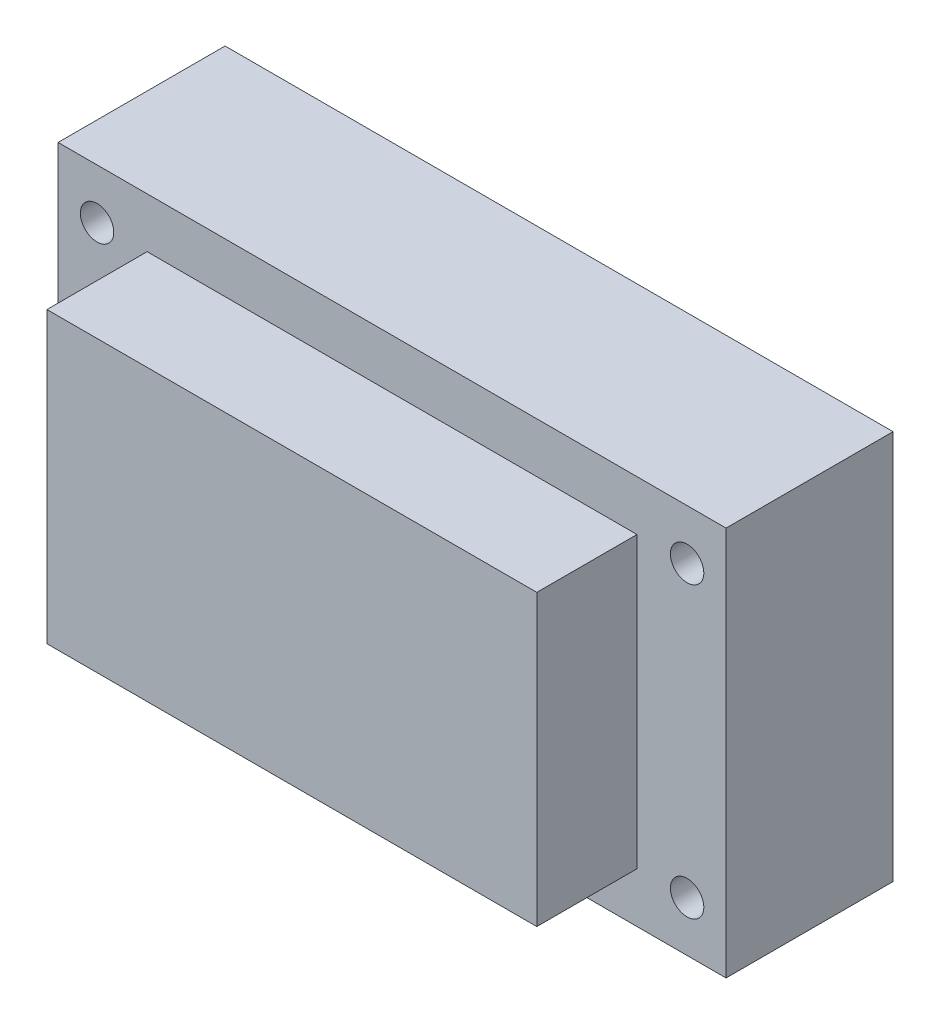
ISO-10303-21;
HEADER;
FILE_DESCRIPTION(('STEP AP214'),'2;1');
FILE_NAME('part.step','',(''),(''),'','','');
FILE_SCHEMA(('AUTOMOTIVE_DESIGN { 1 0 10303 214 1 1 1 1 }'));
ENDSEC;
DATA;
#1=APPLICATION_CONTEXT('core data for automotive mechanical design processes');
#2=APPLICATION_PROTOCOL_DEFINITION('international standard','automotive_design',2000,#1);
#3=PRODUCT_CONTEXT('',#1,'mechanical');
#4=PRODUCT('Part','Part','',(#3));
#5=PRODUCT_RELATED_PRODUCT_CATEGORY('part','',(#4));
#6=PRODUCT_DEFINITION_FORMATION('','',#4);
#7=PRODUCT_DEFINITION_CONTEXT('part definition',#1,'design');
#8=PRODUCT_DEFINITION('design','',#6,#7);
#9=PRODUCT_DEFINITION_SHAPE('','',#8);
#10=(LENGTH_UNIT() NAMED_UNIT(*) SI_UNIT(.MILLI.,.METRE.));
#11=(NAMED_UNIT(*) PLANE_ANGLE_UNIT() SI_UNIT($,.RADIAN.));
#12=(NAMED_UNIT(*) SI_UNIT($,.STERADIAN.) SOLID_ANGLE_UNIT());
#13=UNCERTAINTY_MEASURE_WITH_UNIT(LENGTH_MEASURE(1.E-05),#10,'distance_accuracy_value','');
#14=(GEOMETRIC_REPRESENTATION_CONTEXT(3) GLOBAL_UNCERTAINTY_ASSIGNED_CONTEXT((#13)) GLOBAL_UNIT_ASSIGNED_CONTEXT((#10,
#11,#12)) REPRESENTATION_CONTEXT('',''));
#15=CARTESIAN_POINT('',(0.,0.,0.));
#16=DIRECTION('',(0.,0.,1.));
#17=DIRECTION('',(1.,0.,0.));
#18=AXIS2_PLACEMENT_3D('',#15,#16,#17);
#19=CARTESIAN_POINT('',(0.,0.,9.));
#20=DIRECTION('',(1.,0.,0.));
#21=DIRECTION('',(0.,0.,-1.));
#22=AXIS2_PLACEMENT_3D('',#19,#20,#21);
#23=PLANE('',#22);
#24=DIRECTION('',(0.,-1.,0.));
#25=VECTOR('',#24,1.);
#26=CARTESIAN_POINT('',(0.,0.,0.));
#27=LINE('',#26,#25);
#28=CARTESIAN_POINT('',(0.,26.,0.));
#29=VERTEX_POINT('',#28);
#30=CARTESIAN_POINT('',(0.,0.,0.));
#31=VERTEX_POINT('',#30);
#32=EDGE_CURVE('E118',#29,#31,#27,.T.);
#33=ORIENTED_EDGE('',*,*,#32,.T.);
#34=DIRECTION('',(0.,0.,-1.));
#35=VECTOR('',#34,1.);
#36=CARTESIAN_POINT('',(0.,0.,9.));
#37=LINE('',#36,#35);
#38=CARTESIAN_POINT('',(0.,0.,9.));
#39=VERTEX_POINT('',#38);
#40=EDGE_CURVE('E11',#39,#31,#37,.T.);
#41=ORIENTED_EDGE('',*,*,#40,.F.);
#42=DIRECTION('',(0.,-1.,0.));
#43=VECTOR('',#42,1.);
#44=CARTESIAN_POINT('',(0.,0.,9.));
#45=LINE('',#44,#43);
#46=CARTESIAN_POINT('',(0.,26.,9.));
#47=VERTEX_POINT('',#46);
#48=EDGE_CURVE('E127',#47,#39,#45,.T.);
#49=ORIENTED_EDGE('',*,*,#48,.F.);
#50=DIRECTION('',(0.,0.,-1.));
#51=VECTOR('',#50,1.);
#52=CARTESIAN_POINT('',(0.,26.,9.));
#53=LINE('',#52,#51);
#54=EDGE_CURVE('E134',#47,#29,#53,.T.);
#55=ORIENTED_EDGE('',*,*,#54,.T.);
#56=EDGE_LOOP('',(#33,#41,#49,#55));
#57=FACE_BOUND('',#56,.T.);
#58=ADVANCED_FACE('F32',(#57),#23,.F.);
#59=CARTESIAN_POINT('',(0.,0.,9.));
#60=DIRECTION('',(0.,1.,0.));
#61=DIRECTION('',(0.,0.,1.));
#62=AXIS2_PLACEMENT_3D('',#59,#60,#61);
#63=PLANE('',#62);
#64=DIRECTION('',(1.,0.,0.));
#65=VECTOR('',#64,1.);
#66=CARTESIAN_POINT('',(0.,0.,0.));
#67=LINE('',#66,#65);
#68=CARTESIAN_POINT('',(44.,0.,0.));
#69=VERTEX_POINT('',#68);
#70=EDGE_CURVE('E121',#31,#69,#67,.T.);
#71=ORIENTED_EDGE('',*,*,#70,.T.);
#72=DIRECTION('',(0.,0.,-1.));
#73=VECTOR('',#72,1.);
#74=CARTESIAN_POINT('',(44.,0.,9.));
#75=LINE('',#74,#73);
#76=CARTESIAN_POINT('',(44.,0.,9.));
#77=VERTEX_POINT('',#76);
#78=EDGE_CURVE('E40',#77,#69,#75,.T.);
#79=ORIENTED_EDGE('',*,*,#78,.F.);
#80=DIRECTION('',(1.,0.,0.));
#81=VECTOR('',#80,1.);
#82=CARTESIAN_POINT('',(0.,0.,9.));
#83=LINE('',#82,#81);
#84=EDGE_CURVE('E129',#39,#77,#83,.T.);
#85=ORIENTED_EDGE('',*,*,#84,.F.);
#86=ORIENTED_EDGE('',*,*,#40,.T.);
#87=EDGE_LOOP('',(#71,#79,#85,#86));
#88=FACE_BOUND('',#87,.T.);
#89=ADVANCED_FACE('F154',(#88),#63,.F.);
#90=CARTESIAN_POINT('',(44.,0.,9.));
#91=DIRECTION('',(-1.,0.,0.));
#92=DIRECTION('',(0.,0.,1.));
#93=AXIS2_PLACEMENT_3D('',#90,#91,#92);
#94=PLANE('',#93);
#95=DIRECTION('',(0.,1.,0.));
#96=VECTOR('',#95,1.);
#97=CARTESIAN_POINT('',(44.,0.,0.));
#98=LINE('',#97,#96);
#99=CARTESIAN_POINT('',(44.,26.,0.));
#100=VERTEX_POINT('',#99);
#101=EDGE_CURVE('E138',#69,#100,#98,.T.);
#102=ORIENTED_EDGE('',*,*,#101,.T.);
#103=DIRECTION('',(0.,0.,-1.));
#104=VECTOR('',#103,1.);
#105=CARTESIAN_POINT('',(44.,26.,9.));
#106=LINE('',#105,#104);
#107=CARTESIAN_POINT('',(44.,26.,9.));
#108=VERTEX_POINT('',#107);
#109=EDGE_CURVE('E145',#108,#100,#106,.T.);
#110=ORIENTED_EDGE('',*,*,#109,.F.);
#111=DIRECTION('',(0.,1.,0.));
#112=VECTOR('',#111,1.);
#113=CARTESIAN_POINT('',(44.,0.,9.));
#114=LINE('',#113,#112);
#115=EDGE_CURVE('E132',#77,#108,#114,.T.);
#116=ORIENTED_EDGE('',*,*,#115,.F.);
#117=ORIENTED_EDGE('',*,*,#78,.T.);
#118=EDGE_LOOP('',(#102,#110,#116,#117));
#119=FACE_BOUND('',#118,.T.);
#120=ADVANCED_FACE('F151',(#119),#94,.F.);
#121=CARTESIAN_POINT('',(0.,26.,9.));
#122=DIRECTION('',(0.,-1.,0.));
#123=DIRECTION('',(0.,0.,-1.));
#124=AXIS2_PLACEMENT_3D('',#121,#122,#123);
#125=PLANE('',#124);
#126=DIRECTION('',(-1.,0.,0.));
#127=VECTOR('',#126,1.);
#128=CARTESIAN_POINT('',(0.,26.,0.));
#129=LINE('',#128,#127);
#130=EDGE_CURVE('E130',#100,#29,#129,.T.);
#131=ORIENTED_EDGE('',*,*,#130,.T.);
#132=ORIENTED_EDGE('',*,*,#54,.F.);
#133=DIRECTION('',(-1.,0.,0.));
#134=VECTOR('',#133,1.);
#135=CARTESIAN_POINT('',(0.,26.,9.));
#136=LINE('',#135,#134);
#137=EDGE_CURVE('E47',#108,#47,#136,.T.);
#138=ORIENTED_EDGE('',*,*,#137,.F.);
#139=ORIENTED_EDGE('',*,*,#109,.T.);
#140=EDGE_LOOP('',(#131,#132,#138,#139));
#141=FACE_BOUND('',#140,.T.);
#142=ADVANCED_FACE('F160',(#141),#125,.F.);
#143=CARTESIAN_POINT('',(0.,0.,9.));
#144=DIRECTION('',(0.,0.,-1.));
#145=DIRECTION('',(-1.,0.,0.));
#146=AXIS2_PLACEMENT_3D('',#143,#144,#145);
#147=PLANE('',#146);
#148=ORIENTED_EDGE('',*,*,#48,.T.);
#149=ORIENTED_EDGE('',*,*,#84,.T.);
#150=ORIENTED_EDGE('',*,*,#115,.T.);
#151=ORIENTED_EDGE('',*,*,#137,.T.);
#152=EDGE_LOOP('',(#148,#149,#150,#151));
#153=FACE_BOUND('',#152,.T.);
#154=ADVANCED_FACE('F163',(#153),#147,.F.);
#155=CARTESIAN_POINT('',(0.,0.,0.));
#156=DIRECTION('',(0.,0.,-1.));
#157=DIRECTION('',(-1.,0.,0.));
#158=AXIS2_PLACEMENT_3D('',#155,#156,#157);
#159=PLANE('',#158);
#160=DIRECTION('',(0.,1.,0.));
#161=VECTOR('',#160,1.);
#162=CARTESIAN_POINT('',(-8.,30.5,0.));
#163=LINE('',#162,#161);
#164=CARTESIAN_POINT('',(-8.,-4.5,0.));
#165=VERTEX_POINT('',#164);
#166=CARTESIAN_POINT('',(-8.,30.5,0.));
#167=VERTEX_POINT('',#166);
#168=EDGE_CURVE('E117',#165,#167,#163,.T.);
#169=ORIENTED_EDGE('',*,*,#168,.F.);
#170=DIRECTION('',(-1.,0.,0.));
#171=VECTOR('',#170,1.);
#172=CARTESIAN_POINT('',(52.,-4.5,0.));
#173=LINE('',#172,#171);
#174=CARTESIAN_POINT('',(52.,-4.5,0.));
#175=VERTEX_POINT('',#174);
#176=EDGE_CURVE('E113',#175,#165,#173,.T.);
#177=ORIENTED_EDGE('',*,*,#176,.F.);
#178=DIRECTION('',(0.,-1.,0.));
#179=VECTOR('',#178,1.);
#180=CARTESIAN_POINT('',(52.,30.5,0.));
#181=LINE('',#180,#179);
#182=CARTESIAN_POINT('',(52.,30.5,0.));
#183=VERTEX_POINT('',#182);
#184=EDGE_CURVE('E318',#183,#175,#181,.T.);
#185=ORIENTED_EDGE('',*,*,#184,.F.);
#186=DIRECTION('',(1.,0.,0.));
#187=VECTOR('',#186,1.);
#188=CARTESIAN_POINT('',(52.,30.5,0.));
#189=LINE('',#188,#187);
#190=EDGE_CURVE('E316',#167,#183,#189,.T.);
#191=ORIENTED_EDGE('',*,*,#190,.F.);
#192=EDGE_LOOP('',(#169,#177,#185,#191));
#193=FACE_BOUND('',#192,.T.);
#194=CARTESIAN_POINT('',(48.5,26.,0.));
#195=DIRECTION('',(0.,0.,-1.));
#196=DIRECTION('',(-1.,0.,0.));
#197=AXIS2_PLACEMENT_3D('',#194,#195,#196);
#198=CIRCLE('',#197,1.5);
#199=CARTESIAN_POINT('',(47.,26.,0.));
#200=VERTEX_POINT('',#199);
#201=EDGE_CURVE('E304',#200,#200,#198,.T.);
#202=ORIENTED_EDGE('',*,*,#201,.T.);
#203=EDGE_LOOP('',(#202));
#204=FACE_BOUND('',#203,.T.);
#205=CARTESIAN_POINT('',(-4.5,26.,0.));
#206=DIRECTION('',(0.,0.,-1.));
#207=DIRECTION('',(1.,0.,0.));
#208=AXIS2_PLACEMENT_3D('',#205,#206,#207);
#209=CIRCLE('',#208,1.5);
#210=CARTESIAN_POINT('',(-2.99999999999999,26.,0.));
#211=VERTEX_POINT('',#210);
#212=EDGE_CURVE('E298',#211,#211,#209,.T.);
#213=ORIENTED_EDGE('',*,*,#212,.T.);
#214=EDGE_LOOP('',(#213));
#215=FACE_BOUND('',#214,.T.);
#216=CARTESIAN_POINT('',(48.5,0.,0.));
#217=DIRECTION('',(0.,0.,-1.));
#218=DIRECTION('',(-1.,0.,0.));
#219=AXIS2_PLACEMENT_3D('',#216,#217,#218);
#220=CIRCLE('',#219,1.5);
#221=CARTESIAN_POINT('',(47.,0.,0.));
#222=VERTEX_POINT('',#221);
#223=EDGE_CURVE('E292',#222,#222,#220,.T.);
#224=ORIENTED_EDGE('',*,*,#223,.T.);
#225=EDGE_LOOP('',(#224));
#226=FACE_BOUND('',#225,.T.);
#227=CARTESIAN_POINT('',(-4.5,0.,0.));
#228=DIRECTION('',(0.,0.,-1.));
#229=DIRECTION('',(1.,0.,0.));
#230=AXIS2_PLACEMENT_3D('',#227,#228,#229);
#231=CIRCLE('',#230,1.5);
#232=CARTESIAN_POINT('',(-3.,0.,0.));
#233=VERTEX_POINT('',#232);
#234=EDGE_CURVE('E289',#233,#233,#231,.T.);
#235=ORIENTED_EDGE('',*,*,#234,.T.);
#236=EDGE_LOOP('',(#235));
#237=FACE_BOUND('',#236,.T.);
#238=ORIENTED_EDGE('',*,*,#70,.F.);
#239=ORIENTED_EDGE('',*,*,#32,.F.);
#240=ORIENTED_EDGE('',*,*,#130,.F.);
#241=ORIENTED_EDGE('',*,*,#101,.F.);
#242=EDGE_LOOP('',(#238,#239,#240,#241));
#243=FACE_BOUND('',#242,.T.);
#244=ADVANCED_FACE('F158',(#193,#204,#215,#226,#237,#243),#159,.F.);
#245=CARTESIAN_POINT('',(0.,0.,-15.));
#246=DIRECTION('',(0.,0.,-1.));
#247=DIRECTION('',(-1.,0.,0.));
#248=AXIS2_PLACEMENT_3D('',#245,#246,#247);
#249=PLANE('',#248);
#250=CARTESIAN_POINT('',(48.5,0.,-15.));
#251=DIRECTION('',(0.,0.,-1.));
#252=DIRECTION('',(-1.,0.,0.));
#253=AXIS2_PLACEMENT_3D('',#250,#251,#252);
#254=CIRCLE('',#253,1.5);
#255=CARTESIAN_POINT('',(47.,0.,-15.));
#256=VERTEX_POINT('',#255);
#257=EDGE_CURVE('E295',#256,#256,#254,.T.);
#258=ORIENTED_EDGE('',*,*,#257,.F.);
#259=EDGE_LOOP('',(#258));
#260=FACE_BOUND('',#259,.T.);
#261=CARTESIAN_POINT('',(48.5,26.,-15.));
#262=DIRECTION('',(0.,0.,-1.));
#263=DIRECTION('',(-1.,0.,0.));
#264=AXIS2_PLACEMENT_3D('',#261,#262,#263);
#265=CIRCLE('',#264,1.5);
#266=CARTESIAN_POINT('',(47.,26.,-15.));
#267=VERTEX_POINT('',#266);
#268=EDGE_CURVE('E307',#267,#267,#265,.T.);
#269=ORIENTED_EDGE('',*,*,#268,.F.);
#270=EDGE_LOOP('',(#269));
#271=FACE_BOUND('',#270,.T.);
#272=DIRECTION('',(0.,1.,0.));
#273=VECTOR('',#272,1.);
#274=CARTESIAN_POINT('',(-8.,30.5,-15.));
#275=LINE('',#274,#273);
#276=CARTESIAN_POINT('',(-8.,-4.5,-15.));
#277=VERTEX_POINT('',#276);
#278=CARTESIAN_POINT('',(-8.,30.5,-15.));
#279=VERTEX_POINT('',#278);
#280=EDGE_CURVE('E103',#277,#279,#275,.T.);
#281=ORIENTED_EDGE('',*,*,#280,.T.);
#282=DIRECTION('',(1.,0.,0.));
#283=VECTOR('',#282,1.);
#284=CARTESIAN_POINT('',(52.,30.5,-15.));
#285=LINE('',#284,#283);
#286=CARTESIAN_POINT('',(52.,30.5,-15.));
#287=VERTEX_POINT('',#286);
#288=EDGE_CURVE('E92',#279,#287,#285,.T.);
#289=ORIENTED_EDGE('',*,*,#288,.T.);
#290=DIRECTION('',(0.,-1.,0.));
#291=VECTOR('',#290,1.);
#292=CARTESIAN_POINT('',(52.,30.5,-15.));
#293=LINE('',#292,#291);
#294=CARTESIAN_POINT('',(52.,-4.5,-15.));
#295=VERTEX_POINT('',#294);
#296=EDGE_CURVE('E102',#287,#295,#293,.T.);
#297=ORIENTED_EDGE('',*,*,#296,.T.);
#298=DIRECTION('',(-1.,0.,0.));
#299=VECTOR('',#298,1.);
#300=CARTESIAN_POINT('',(52.,-4.5,-15.));
#301=LINE('',#300,#299);
#302=EDGE_CURVE('E109',#295,#277,#301,.T.);
#303=ORIENTED_EDGE('',*,*,#302,.T.);
#304=EDGE_LOOP('',(#281,#289,#297,#303));
#305=FACE_BOUND('',#304,.T.);
#306=CARTESIAN_POINT('',(-4.5,26.,-15.));
#307=DIRECTION('',(0.,0.,-1.));
#308=DIRECTION('',(1.,0.,0.));
#309=AXIS2_PLACEMENT_3D('',#306,#307,#308);
#310=CIRCLE('',#309,1.5);
#311=CARTESIAN_POINT('',(-2.99999999999999,26.,-15.));
#312=VERTEX_POINT('',#311);
#313=EDGE_CURVE('E301',#312,#312,#310,.T.);
#314=ORIENTED_EDGE('',*,*,#313,.F.);
#315=EDGE_LOOP('',(#314));
#316=FACE_BOUND('',#315,.T.);
#317=CARTESIAN_POINT('',(-4.5,0.,-15.));
#318=DIRECTION('',(0.,0.,-1.));
#319=DIRECTION('',(1.,0.,0.));
#320=AXIS2_PLACEMENT_3D('',#317,#318,#319);
#321=CIRCLE('',#320,1.5);
#322=CARTESIAN_POINT('',(-3.,0.,-15.));
#323=VERTEX_POINT('',#322);
#324=EDGE_CURVE('E286',#323,#323,#321,.T.);
#325=ORIENTED_EDGE('',*,*,#324,.F.);
#326=EDGE_LOOP('',(#325));
#327=FACE_BOUND('',#326,.T.);
#328=ADVANCED_FACE('F106',(#260,#271,#305,#316,#327),#249,.T.);
#329=CARTESIAN_POINT('',(-8.,30.5,-15.));
#330=DIRECTION('',(1.,0.,0.));
#331=DIRECTION('',(0.,1.,0.));
#332=AXIS2_PLACEMENT_3D('',#329,#330,#331);
#333=PLANE('',#332);
#334=ORIENTED_EDGE('',*,*,#168,.T.);
#335=DIRECTION('',(0.,0.,1.));
#336=VECTOR('',#335,1.);
#337=CARTESIAN_POINT('',(-8.,30.5,-15.));
#338=LINE('',#337,#336);
#339=EDGE_CURVE('E96',#279,#167,#338,.T.);
#340=ORIENTED_EDGE('',*,*,#339,.F.);
#341=ORIENTED_EDGE('',*,*,#280,.F.);
#342=DIRECTION('',(0.,0.,1.));
#343=VECTOR('',#342,1.);
#344=CARTESIAN_POINT('',(-8.,-4.5,-15.));
#345=LINE('',#344,#343);
#346=EDGE_CURVE('E314',#277,#165,#345,.T.);
#347=ORIENTED_EDGE('',*,*,#346,.T.);
#348=EDGE_LOOP('',(#334,#340,#341,#347));
#349=FACE_BOUND('',#348,.T.);
#350=ADVANCED_FACE('F115',(#349),#333,.F.);
#351=CARTESIAN_POINT('',(52.,30.5,-15.));
#352=DIRECTION('',(0.,-1.,0.));
#353=DIRECTION('',(0.,0.,-1.));
#354=AXIS2_PLACEMENT_3D('',#351,#352,#353);
#355=PLANE('',#354);
#356=ORIENTED_EDGE('',*,*,#190,.T.);
#357=DIRECTION('',(0.,0.,1.));
#358=VECTOR('',#357,1.);
#359=CARTESIAN_POINT('',(52.,30.5,-15.));
#360=LINE('',#359,#358);
#361=EDGE_CURVE('E99',#287,#183,#360,.T.);
#362=ORIENTED_EDGE('',*,*,#361,.F.);
#363=ORIENTED_EDGE('',*,*,#288,.F.);
#364=ORIENTED_EDGE('',*,*,#339,.T.);
#365=EDGE_LOOP('',(#356,#362,#363,#364));
#366=FACE_BOUND('',#365,.T.);
#367=ADVANCED_FACE('F94',(#366),#355,.F.);
#368=CARTESIAN_POINT('',(52.,30.5,-15.));
#369=DIRECTION('',(-1.,0.,0.));
#370=DIRECTION('',(0.,-1.,0.));
#371=AXIS2_PLACEMENT_3D('',#368,#369,#370);
#372=PLANE('',#371);
#373=ORIENTED_EDGE('',*,*,#184,.T.);
#374=DIRECTION('',(0.,0.,1.));
#375=VECTOR('',#374,1.);
#376=CARTESIAN_POINT('',(52.,-4.5,-15.));
#377=LINE('',#376,#375);
#378=EDGE_CURVE('E123',#295,#175,#377,.T.);
#379=ORIENTED_EDGE('',*,*,#378,.F.);
#380=ORIENTED_EDGE('',*,*,#296,.F.);
#381=ORIENTED_EDGE('',*,*,#361,.T.);
#382=EDGE_LOOP('',(#373,#379,#380,#381));
#383=FACE_BOUND('',#382,.T.);
#384=ADVANCED_FACE('F220',(#383),#372,.F.);
#385=CARTESIAN_POINT('',(52.,-4.5,-15.));
#386=DIRECTION('',(0.,1.,0.));
#387=DIRECTION('',(0.,0.,1.));
#388=AXIS2_PLACEMENT_3D('',#385,#386,#387);
#389=PLANE('',#388);
#390=ORIENTED_EDGE('',*,*,#176,.T.);
#391=ORIENTED_EDGE('',*,*,#346,.F.);
#392=ORIENTED_EDGE('',*,*,#302,.F.);
#393=ORIENTED_EDGE('',*,*,#378,.T.);
#394=EDGE_LOOP('',(#390,#391,#392,#393));
#395=FACE_BOUND('',#394,.T.);
#396=ADVANCED_FACE('F229',(#395),#389,.F.);
#397=CARTESIAN_POINT('',(48.5,26.,-15.));
#398=DIRECTION('',(0.,0.,1.));
#399=DIRECTION('',(1.,0.,0.));
#400=AXIS2_PLACEMENT_3D('',#397,#398,#399);
#401=CYLINDRICAL_SURFACE('',#400,1.5);
#402=ORIENTED_EDGE('',*,*,#268,.T.);
#403=EDGE_LOOP('',(#402));
#404=FACE_BOUND('',#403,.T.);
#405=ORIENTED_EDGE('',*,*,#201,.F.);
#406=EDGE_LOOP('',(#405));
#407=FACE_BOUND('',#406,.T.);
#408=ADVANCED_FACE('F239',(#404,#407),#401,.F.);
#409=CARTESIAN_POINT('',(-4.5,26.,-15.));
#410=DIRECTION('',(0.,0.,1.));
#411=DIRECTION('',(1.,0.,0.));
#412=AXIS2_PLACEMENT_3D('',#409,#410,#411);
#413=CYLINDRICAL_SURFACE('',#412,1.5);
#414=ORIENTED_EDGE('',*,*,#313,.T.);
#415=EDGE_LOOP('',(#414));
#416=FACE_BOUND('',#415,.T.);
#417=ORIENTED_EDGE('',*,*,#212,.F.);
#418=EDGE_LOOP('',(#417));
#419=FACE_BOUND('',#418,.T.);
#420=ADVANCED_FACE('F249',(#416,#419),#413,.F.);
#421=CARTESIAN_POINT('',(48.5,0.,-15.));
#422=DIRECTION('',(0.,0.,1.));
#423=DIRECTION('',(1.,0.,0.));
#424=AXIS2_PLACEMENT_3D('',#421,#422,#423);
#425=CYLINDRICAL_SURFACE('',#424,1.5);
#426=ORIENTED_EDGE('',*,*,#257,.T.);
#427=EDGE_LOOP('',(#426));
#428=FACE_BOUND('',#427,.T.);
#429=ORIENTED_EDGE('',*,*,#223,.F.);
#430=EDGE_LOOP('',(#429));
#431=FACE_BOUND('',#430,.T.);
#432=ADVANCED_FACE('F259',(#428,#431),#425,.F.);
#433=CARTESIAN_POINT('',(-4.5,0.,-15.));
#434=DIRECTION('',(0.,0.,1.));
#435=DIRECTION('',(1.,0.,0.));
#436=AXIS2_PLACEMENT_3D('',#433,#434,#435);
#437=CYLINDRICAL_SURFACE('',#436,1.5);
#438=ORIENTED_EDGE('',*,*,#324,.T.);
#439=EDGE_LOOP('',(#438));
#440=FACE_BOUND('',#439,.T.);
#441=ORIENTED_EDGE('',*,*,#234,.F.);
#442=EDGE_LOOP('',(#441));
#443=FACE_BOUND('',#442,.T.);
#444=ADVANCED_FACE('F269',(#440,#443),#437,.F.);
#445=CLOSED_SHELL('',(#58,#89,#120,#142,#154,#244,#328,#350,#367,#384,#396,#408,#420,#432,#444));
#446=MANIFOLD_SOLID_BREP('B2',#445);
#447=ADVANCED_BREP_SHAPE_REPRESENTATION('',(#18,#446),#14);
#448=SHAPE_DEFINITION_REPRESENTATION(#9,#447);
ENDSEC;
END-ISO-10303-21;
